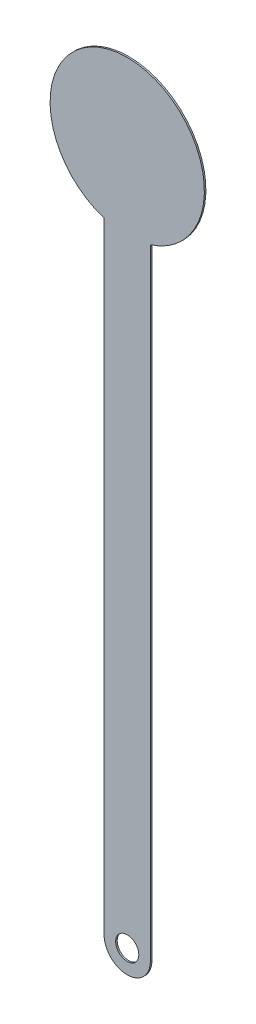
ISO-10303-21;
HEADER;
FILE_DESCRIPTION(('STEP AP214'),'2;1');
FILE_NAME('part.step','',(''),(''),'','','');
FILE_SCHEMA(('AUTOMOTIVE_DESIGN { 1 0 10303 214 1 1 1 1 }'));
ENDSEC;
DATA;
#1=APPLICATION_CONTEXT('core data for automotive mechanical design processes');
#2=APPLICATION_PROTOCOL_DEFINITION('international standard','automotive_design',2000,#1);
#3=PRODUCT_CONTEXT('',#1,'mechanical');
#4=PRODUCT('Part','Part','',(#3));
#5=PRODUCT_RELATED_PRODUCT_CATEGORY('part','',(#4));
#6=PRODUCT_DEFINITION_FORMATION('','',#4);
#7=PRODUCT_DEFINITION_CONTEXT('part definition',#1,'design');
#8=PRODUCT_DEFINITION('design','',#6,#7);
#9=PRODUCT_DEFINITION_SHAPE('','',#8);
#10=(LENGTH_UNIT() NAMED_UNIT(*) SI_UNIT(.MILLI.,.METRE.));
#11=(NAMED_UNIT(*) PLANE_ANGLE_UNIT() SI_UNIT($,.RADIAN.));
#12=(NAMED_UNIT(*) SI_UNIT($,.STERADIAN.) SOLID_ANGLE_UNIT());
#13=UNCERTAINTY_MEASURE_WITH_UNIT(LENGTH_MEASURE(1.E-05),#10,'distance_accuracy_value','');
#14=(GEOMETRIC_REPRESENTATION_CONTEXT(3) GLOBAL_UNCERTAINTY_ASSIGNED_CONTEXT((#13)) GLOBAL_UNIT_ASSIGNED_CONTEXT((#10,
#11,#12)) REPRESENTATION_CONTEXT('',''));
#15=CARTESIAN_POINT('',(0.,0.,0.));
#16=DIRECTION('',(0.,0.,1.));
#17=DIRECTION('',(1.,0.,0.));
#18=AXIS2_PLACEMENT_3D('',#15,#16,#17);
#19=CARTESIAN_POINT('',(0.,0.,0.1));
#20=DIRECTION('',(0.,0.,1.));
#21=DIRECTION('',(1.,0.,0.));
#22=AXIS2_PLACEMENT_3D('',#19,#20,#21);
#23=PLANE('',#22);
#24=CARTESIAN_POINT('',(0.,0.,0.1));
#25=DIRECTION('',(0.,0.,1.));
#26=DIRECTION('',(1.,0.,0.));
#27=AXIS2_PLACEMENT_3D('',#24,#25,#26);
#28=CIRCLE('',#27,5.);
#29=CARTESIAN_POINT('',(1.5,-4.76969600708473,0.1));
#30=VERTEX_POINT('',#29);
#31=CARTESIAN_POINT('',(-1.5,-4.76969600708473,0.1));
#32=VERTEX_POINT('',#31);
#33=EDGE_CURVE('E87',#30,#32,#28,.T.);
#34=ORIENTED_EDGE('',*,*,#33,.T.);
#35=DIRECTION('',(0.,-1.,0.));
#36=VECTOR('',#35,1.);
#37=CARTESIAN_POINT('',(-1.5,-4.76969600708473,0.1));
#38=LINE('',#37,#36);
#39=CARTESIAN_POINT('',(-1.49999999999999,-45.,0.1));
#40=VERTEX_POINT('',#39);
#41=EDGE_CURVE('E82',#32,#40,#38,.T.);
#42=ORIENTED_EDGE('',*,*,#41,.T.);
#43=CARTESIAN_POINT('',(0.,-45.,0.1));
#44=DIRECTION('',(0.,0.,1.));
#45=DIRECTION('',(1.,0.,0.));
#46=AXIS2_PLACEMENT_3D('',#43,#44,#45);
#47=CIRCLE('',#46,1.5);
#48=CARTESIAN_POINT('',(1.50000000000001,-45.,0.1));
#49=VERTEX_POINT('',#48);
#50=EDGE_CURVE('E85',#40,#49,#47,.T.);
#51=ORIENTED_EDGE('',*,*,#50,.T.);
#52=DIRECTION('',(0.,1.,0.));
#53=VECTOR('',#52,1.);
#54=CARTESIAN_POINT('',(1.5,-4.76969600708473,0.1));
#55=LINE('',#54,#53);
#56=EDGE_CURVE('E52',#49,#30,#55,.T.);
#57=ORIENTED_EDGE('',*,*,#56,.T.);
#58=EDGE_LOOP('',(#34,#42,#51,#57));
#59=FACE_BOUND('',#58,.T.);
#60=CARTESIAN_POINT('',(0.,-45.,0.1));
#61=DIRECTION('',(0.,0.,1.));
#62=DIRECTION('',(1.,0.,0.));
#63=AXIS2_PLACEMENT_3D('',#60,#61,#62);
#64=CIRCLE('',#63,0.750000000000001);
#65=CARTESIAN_POINT('',(0.750000000000006,-45.,0.1));
#66=VERTEX_POINT('',#65);
#67=EDGE_CURVE('E102',#66,#66,#64,.T.);
#68=ORIENTED_EDGE('',*,*,#67,.F.);
#69=EDGE_LOOP('',(#68));
#70=FACE_BOUND('',#69,.T.);
#71=ADVANCED_FACE('F35',(#59,#70),#23,.T.);
#72=CARTESIAN_POINT('',(0.,0.,0.));
#73=DIRECTION('',(0.,0.,1.));
#74=DIRECTION('',(1.,0.,0.));
#75=AXIS2_PLACEMENT_3D('',#72,#73,#74);
#76=PLANE('',#75);
#77=CARTESIAN_POINT('',(0.,0.,0.));
#78=DIRECTION('',(0.,0.,1.));
#79=DIRECTION('',(1.,0.,0.));
#80=AXIS2_PLACEMENT_3D('',#77,#78,#79);
#81=CIRCLE('',#80,5.);
#82=CARTESIAN_POINT('',(1.5,-4.76969600708473,0.));
#83=VERTEX_POINT('',#82);
#84=CARTESIAN_POINT('',(-1.5,-4.76969600708473,0.));
#85=VERTEX_POINT('',#84);
#86=EDGE_CURVE('E99',#83,#85,#81,.T.);
#87=ORIENTED_EDGE('',*,*,#86,.F.);
#88=DIRECTION('',(0.,1.,0.));
#89=VECTOR('',#88,1.);
#90=CARTESIAN_POINT('',(1.5,-4.76969600708473,0.));
#91=LINE('',#90,#89);
#92=CARTESIAN_POINT('',(1.50000000000001,-45.,0.));
#93=VERTEX_POINT('',#92);
#94=EDGE_CURVE('E75',#93,#83,#91,.T.);
#95=ORIENTED_EDGE('',*,*,#94,.F.);
#96=CARTESIAN_POINT('',(0.,-45.,0.));
#97=DIRECTION('',(0.,0.,1.));
#98=DIRECTION('',(1.,0.,0.));
#99=AXIS2_PLACEMENT_3D('',#96,#97,#98);
#100=CIRCLE('',#99,1.5);
#101=CARTESIAN_POINT('',(-1.49999999999999,-45.,0.));
#102=VERTEX_POINT('',#101);
#103=EDGE_CURVE('E69',#102,#93,#100,.T.);
#104=ORIENTED_EDGE('',*,*,#103,.F.);
#105=DIRECTION('',(0.,-1.,0.));
#106=VECTOR('',#105,1.);
#107=CARTESIAN_POINT('',(-1.5,-4.76969600708473,0.));
#108=LINE('',#107,#106);
#109=EDGE_CURVE('E91',#85,#102,#108,.T.);
#110=ORIENTED_EDGE('',*,*,#109,.F.);
#111=EDGE_LOOP('',(#87,#95,#104,#110));
#112=FACE_BOUND('',#111,.T.);
#113=CARTESIAN_POINT('',(0.,-45.,0.));
#114=DIRECTION('',(0.,0.,1.));
#115=DIRECTION('',(1.,0.,0.));
#116=AXIS2_PLACEMENT_3D('',#113,#114,#115);
#117=CIRCLE('',#116,0.750000000000001);
#118=CARTESIAN_POINT('',(0.750000000000006,-45.,0.));
#119=VERTEX_POINT('',#118);
#120=EDGE_CURVE('E114',#119,#119,#117,.T.);
#121=ORIENTED_EDGE('',*,*,#120,.T.);
#122=EDGE_LOOP('',(#121));
#123=FACE_BOUND('',#122,.T.);
#124=ADVANCED_FACE('F110',(#112,#123),#76,.F.);
#125=CARTESIAN_POINT('',(0.,0.,0.1));
#126=DIRECTION('',(0.,0.,-1.));
#127=DIRECTION('',(-1.,0.,0.));
#128=AXIS2_PLACEMENT_3D('',#125,#126,#127);
#129=CYLINDRICAL_SURFACE('',#128,5.);
#130=ORIENTED_EDGE('',*,*,#86,.T.);
#131=DIRECTION('',(0.,0.,-1.));
#132=VECTOR('',#131,1.);
#133=CARTESIAN_POINT('',(-1.5,-4.76969600708473,0.1));
#134=LINE('',#133,#132);
#135=EDGE_CURVE('E11',#32,#85,#134,.T.);
#136=ORIENTED_EDGE('',*,*,#135,.F.);
#137=ORIENTED_EDGE('',*,*,#33,.F.);
#138=DIRECTION('',(0.,0.,-1.));
#139=VECTOR('',#138,1.);
#140=CARTESIAN_POINT('',(1.5,-4.76969600708473,0.1));
#141=LINE('',#140,#139);
#142=EDGE_CURVE('E95',#30,#83,#141,.T.);
#143=ORIENTED_EDGE('',*,*,#142,.T.);
#144=EDGE_LOOP('',(#130,#136,#137,#143));
#145=FACE_BOUND('',#144,.T.);
#146=ADVANCED_FACE('F37',(#145),#129,.T.);
#147=CARTESIAN_POINT('',(-1.5,-4.76969600708473,0.1));
#148=DIRECTION('',(1.,0.,0.));
#149=DIRECTION('',(0.,1.,0.));
#150=AXIS2_PLACEMENT_3D('',#147,#148,#149);
#151=PLANE('',#150);
#152=ORIENTED_EDGE('',*,*,#109,.T.);
#153=DIRECTION('',(0.,0.,-1.));
#154=VECTOR('',#153,1.);
#155=CARTESIAN_POINT('',(-1.49999999999999,-45.,0.1));
#156=LINE('',#155,#154);
#157=EDGE_CURVE('E44',#40,#102,#156,.T.);
#158=ORIENTED_EDGE('',*,*,#157,.F.);
#159=ORIENTED_EDGE('',*,*,#41,.F.);
#160=ORIENTED_EDGE('',*,*,#135,.T.);
#161=EDGE_LOOP('',(#152,#158,#159,#160));
#162=FACE_BOUND('',#161,.T.);
#163=ADVANCED_FACE('F90',(#162),#151,.F.);
#164=CARTESIAN_POINT('',(0.,-45.,0.1));
#165=DIRECTION('',(0.,0.,-1.));
#166=DIRECTION('',(-1.,0.,0.));
#167=AXIS2_PLACEMENT_3D('',#164,#165,#166);
#168=CYLINDRICAL_SURFACE('',#167,1.5);
#169=ORIENTED_EDGE('',*,*,#103,.T.);
#170=DIRECTION('',(0.,0.,-1.));
#171=VECTOR('',#170,1.);
#172=CARTESIAN_POINT('',(1.50000000000001,-45.,0.1));
#173=LINE('',#172,#171);
#174=EDGE_CURVE('E92',#49,#93,#173,.T.);
#175=ORIENTED_EDGE('',*,*,#174,.F.);
#176=ORIENTED_EDGE('',*,*,#50,.F.);
#177=ORIENTED_EDGE('',*,*,#157,.T.);
#178=EDGE_LOOP('',(#169,#175,#176,#177));
#179=FACE_BOUND('',#178,.T.);
#180=ADVANCED_FACE('F93',(#179),#168,.T.);
#181=CARTESIAN_POINT('',(1.5,-4.76969600708473,0.1));
#182=DIRECTION('',(-1.,0.,0.));
#183=DIRECTION('',(0.,-1.,0.));
#184=AXIS2_PLACEMENT_3D('',#181,#182,#183);
#185=PLANE('',#184);
#186=ORIENTED_EDGE('',*,*,#94,.T.);
#187=ORIENTED_EDGE('',*,*,#142,.F.);
#188=ORIENTED_EDGE('',*,*,#56,.F.);
#189=ORIENTED_EDGE('',*,*,#174,.T.);
#190=EDGE_LOOP('',(#186,#187,#188,#189));
#191=FACE_BOUND('',#190,.T.);
#192=ADVANCED_FACE('F107',(#191),#185,.F.);
#193=CARTESIAN_POINT('',(0.,-45.,0.1));
#194=DIRECTION('',(0.,0.,-1.));
#195=DIRECTION('',(-1.,0.,0.));
#196=AXIS2_PLACEMENT_3D('',#193,#194,#195);
#197=CYLINDRICAL_SURFACE('',#196,0.750000000000001);
#198=ORIENTED_EDGE('',*,*,#67,.T.);
#199=EDGE_LOOP('',(#198));
#200=FACE_BOUND('',#199,.T.);
#201=ORIENTED_EDGE('',*,*,#120,.F.);
#202=EDGE_LOOP('',(#201));
#203=FACE_BOUND('',#202,.T.);
#204=ADVANCED_FACE('F120',(#200,#203),#197,.F.);
#205=CLOSED_SHELL('',(#71,#124,#146,#163,#180,#192,#204));
#206=MANIFOLD_SOLID_BREP('B2',#205);
#207=ADVANCED_BREP_SHAPE_REPRESENTATION('',(#18,#206),#14);
#208=SHAPE_DEFINITION_REPRESENTATION(#9,#207);
ENDSEC;
END-ISO-10303-21;
